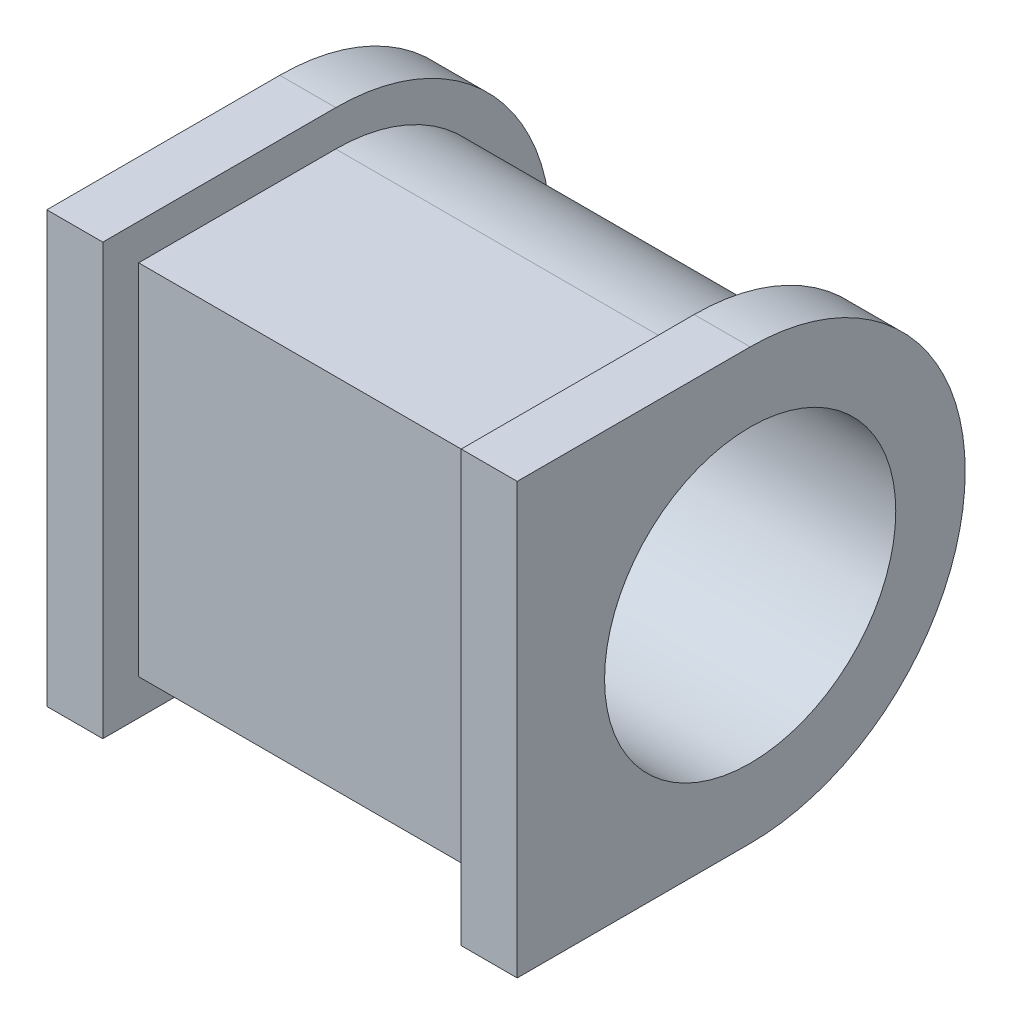
ISO-10303-21;
HEADER;
FILE_DESCRIPTION(('STEP AP214'),'2;1');
FILE_NAME('part.step','',(''),(''),'','','');
FILE_SCHEMA(('AUTOMOTIVE_DESIGN { 1 0 10303 214 1 1 1 1 }'));
ENDSEC;
DATA;
#1=APPLICATION_CONTEXT('core data for automotive mechanical design processes');
#2=APPLICATION_PROTOCOL_DEFINITION('international standard','automotive_design',2000,#1);
#3=PRODUCT_CONTEXT('',#1,'mechanical');
#4=PRODUCT('Part','Part','',(#3));
#5=PRODUCT_RELATED_PRODUCT_CATEGORY('part','',(#4));
#6=PRODUCT_DEFINITION_FORMATION('','',#4);
#7=PRODUCT_DEFINITION_CONTEXT('part definition',#1,'design');
#8=PRODUCT_DEFINITION('design','',#6,#7);
#9=PRODUCT_DEFINITION_SHAPE('','',#8);
#10=(LENGTH_UNIT() NAMED_UNIT(*) SI_UNIT(.MILLI.,.METRE.));
#11=(NAMED_UNIT(*) PLANE_ANGLE_UNIT() SI_UNIT($,.RADIAN.));
#12=(NAMED_UNIT(*) SI_UNIT($,.STERADIAN.) SOLID_ANGLE_UNIT());
#13=UNCERTAINTY_MEASURE_WITH_UNIT(LENGTH_MEASURE(1.E-05),#10,'distance_accuracy_value','');
#14=(GEOMETRIC_REPRESENTATION_CONTEXT(3) GLOBAL_UNCERTAINTY_ASSIGNED_CONTEXT((#13)) GLOBAL_UNIT_ASSIGNED_CONTEXT((#10,
#11,#12)) REPRESENTATION_CONTEXT('',''));
#15=CARTESIAN_POINT('',(0.,0.,0.));
#16=DIRECTION('',(0.,0.,1.));
#17=DIRECTION('',(1.,0.,0.));
#18=AXIS2_PLACEMENT_3D('',#15,#16,#17);
#19=CARTESIAN_POINT('',(12.5,0.,0.));
#20=DIRECTION('',(1.,0.,0.));
#21=DIRECTION('',(0.,0.,-1.));
#22=AXIS2_PLACEMENT_3D('',#19,#20,#21);
#23=PLANE('',#22);
#24=CARTESIAN_POINT('',(12.5,0.,0.));
#25=DIRECTION('',(1.,0.,0.));
#26=DIRECTION('',(0.,0.,-1.));
#27=AXIS2_PLACEMENT_3D('',#24,#25,#26);
#28=CIRCLE('',#27,40.);
#29=CARTESIAN_POINT('',(12.5,-40.,0.));
#30=VERTEX_POINT('',#29);
#31=CARTESIAN_POINT('',(12.5,40.,0.));
#32=VERTEX_POINT('',#31);
#33=EDGE_CURVE('E55',#30,#32,#28,.T.);
#34=ORIENTED_EDGE('',*,*,#33,.F.);
#35=DIRECTION('',(0.,0.,-1.));
#36=VECTOR('',#35,1.);
#37=CARTESIAN_POINT('',(12.5,-40.,44.));
#38=LINE('',#37,#36);
#39=CARTESIAN_POINT('',(12.5,-40.,44.));
#40=VERTEX_POINT('',#39);
#41=EDGE_CURVE('E59',#40,#30,#38,.T.);
#42=ORIENTED_EDGE('',*,*,#41,.F.);
#43=DIRECTION('',(0.,-1.,0.));
#44=VECTOR('',#43,1.);
#45=CARTESIAN_POINT('',(12.5,40.,44.));
#46=LINE('',#45,#44);
#47=CARTESIAN_POINT('',(12.5,40.,44.));
#48=VERTEX_POINT('',#47);
#49=EDGE_CURVE('E185',#48,#40,#46,.T.);
#50=ORIENTED_EDGE('',*,*,#49,.F.);
#51=DIRECTION('',(0.,0.,1.));
#52=VECTOR('',#51,1.);
#53=CARTESIAN_POINT('',(12.5,40.,0.));
#54=LINE('',#53,#52);
#55=EDGE_CURVE('E159',#32,#48,#54,.T.);
#56=ORIENTED_EDGE('',*,*,#55,.F.);
#57=EDGE_LOOP('',(#34,#42,#50,#56));
#58=FACE_BOUND('',#57,.T.);
#59=DIRECTION('',(0.,0.,1.));
#60=VECTOR('',#59,1.);
#61=CARTESIAN_POINT('',(12.5,48.,52.));
#62=LINE('',#61,#60);
#63=CARTESIAN_POINT('',(12.5,48.,0.));
#64=VERTEX_POINT('',#63);
#65=CARTESIAN_POINT('',(12.5,48.,52.));
#66=VERTEX_POINT('',#65);
#67=EDGE_CURVE('E210',#64,#66,#62,.T.);
#68=ORIENTED_EDGE('',*,*,#67,.T.);
#69=DIRECTION('',(0.,-1.,0.));
#70=VECTOR('',#69,1.);
#71=CARTESIAN_POINT('',(12.5,48.,52.));
#72=LINE('',#71,#70);
#73=CARTESIAN_POINT('',(12.5,-48.,52.));
#74=VERTEX_POINT('',#73);
#75=EDGE_CURVE('E214',#66,#74,#72,.T.);
#76=ORIENTED_EDGE('',*,*,#75,.T.);
#77=DIRECTION('',(0.,0.,-1.));
#78=VECTOR('',#77,1.);
#79=CARTESIAN_POINT('',(12.5,-48.,52.));
#80=LINE('',#79,#78);
#81=CARTESIAN_POINT('',(12.5,-48.,0.));
#82=VERTEX_POINT('',#81);
#83=EDGE_CURVE('E218',#74,#82,#80,.T.);
#84=ORIENTED_EDGE('',*,*,#83,.T.);
#85=CARTESIAN_POINT('',(12.5,0.,0.));
#86=DIRECTION('',(1.,0.,0.));
#87=DIRECTION('',(0.,0.,-1.));
#88=AXIS2_PLACEMENT_3D('',#85,#86,#87);
#89=CIRCLE('',#88,48.);
#90=EDGE_CURVE('E221',#82,#64,#89,.T.);
#91=ORIENTED_EDGE('',*,*,#90,.T.);
#92=EDGE_LOOP('',(#68,#76,#84,#91));
#93=FACE_BOUND('',#92,.T.);
#94=ADVANCED_FACE('F39',(#58,#93),#23,.T.);
#95=CARTESIAN_POINT('',(0.,0.,0.));
#96=DIRECTION('',(1.,0.,0.));
#97=DIRECTION('',(0.,0.,-1.));
#98=AXIS2_PLACEMENT_3D('',#95,#96,#97);
#99=PLANE('',#98);
#100=DIRECTION('',(0.,0.,1.));
#101=VECTOR('',#100,1.);
#102=CARTESIAN_POINT('',(0.,48.,52.));
#103=LINE('',#102,#101);
#104=CARTESIAN_POINT('',(0.,48.,0.));
#105=VERTEX_POINT('',#104);
#106=CARTESIAN_POINT('',(0.,48.,52.));
#107=VERTEX_POINT('',#106);
#108=EDGE_CURVE('E209',#105,#107,#103,.T.);
#109=ORIENTED_EDGE('',*,*,#108,.F.);
#110=CARTESIAN_POINT('',(0.,0.,0.));
#111=DIRECTION('',(1.,0.,0.));
#112=DIRECTION('',(0.,0.,-1.));
#113=AXIS2_PLACEMENT_3D('',#110,#111,#112);
#114=CIRCLE('',#113,48.);
#115=CARTESIAN_POINT('',(0.,-48.,0.));
#116=VERTEX_POINT('',#115);
#117=EDGE_CURVE('E215',#116,#105,#114,.T.);
#118=ORIENTED_EDGE('',*,*,#117,.F.);
#119=DIRECTION('',(0.,0.,-1.));
#120=VECTOR('',#119,1.);
#121=CARTESIAN_POINT('',(0.,-48.,52.));
#122=LINE('',#121,#120);
#123=CARTESIAN_POINT('',(0.,-48.,52.));
#124=VERTEX_POINT('',#123);
#125=EDGE_CURVE('E231',#124,#116,#122,.T.);
#126=ORIENTED_EDGE('',*,*,#125,.F.);
#127=DIRECTION('',(0.,-1.,0.));
#128=VECTOR('',#127,1.);
#129=CARTESIAN_POINT('',(0.,48.,52.));
#130=LINE('',#129,#128);
#131=EDGE_CURVE('E228',#107,#124,#130,.T.);
#132=ORIENTED_EDGE('',*,*,#131,.F.);
#133=EDGE_LOOP('',(#109,#118,#126,#132));
#134=FACE_BOUND('',#133,.T.);
#135=CARTESIAN_POINT('',(0.,0.,0.));
#136=DIRECTION('',(1.,0.,0.));
#137=DIRECTION('',(0.,0.,-1.));
#138=AXIS2_PLACEMENT_3D('',#135,#136,#137);
#139=CIRCLE('',#138,32.5);
#140=CARTESIAN_POINT('',(0.,0.,-32.5));
#141=VERTEX_POINT('',#140);
#142=EDGE_CURVE('E205',#141,#141,#139,.T.);
#143=ORIENTED_EDGE('',*,*,#142,.T.);
#144=EDGE_LOOP('',(#143));
#145=FACE_BOUND('',#144,.T.);
#146=ADVANCED_FACE('F254',(#134,#145),#99,.F.);
#147=CARTESIAN_POINT('',(12.5,48.,52.));
#148=DIRECTION('',(0.,-1.,0.));
#149=DIRECTION('',(0.,0.,-1.));
#150=AXIS2_PLACEMENT_3D('',#147,#148,#149);
#151=PLANE('',#150);
#152=ORIENTED_EDGE('',*,*,#108,.T.);
#153=DIRECTION('',(-1.,0.,0.));
#154=VECTOR('',#153,1.);
#155=CARTESIAN_POINT('',(12.5,48.,52.));
#156=LINE('',#155,#154);
#157=EDGE_CURVE('E11',#66,#107,#156,.T.);
#158=ORIENTED_EDGE('',*,*,#157,.F.);
#159=ORIENTED_EDGE('',*,*,#67,.F.);
#160=DIRECTION('',(-1.,0.,0.));
#161=VECTOR('',#160,1.);
#162=CARTESIAN_POINT('',(12.5,48.,0.));
#163=LINE('',#162,#161);
#164=EDGE_CURVE('E224',#64,#105,#163,.T.);
#165=ORIENTED_EDGE('',*,*,#164,.T.);
#166=EDGE_LOOP('',(#152,#158,#159,#165));
#167=FACE_BOUND('',#166,.T.);
#168=ADVANCED_FACE('F41',(#167),#151,.F.);
#169=CARTESIAN_POINT('',(12.5,48.,52.));
#170=DIRECTION('',(0.,0.,-1.));
#171=DIRECTION('',(0.,1.,0.));
#172=AXIS2_PLACEMENT_3D('',#169,#170,#171);
#173=PLANE('',#172);
#174=ORIENTED_EDGE('',*,*,#131,.T.);
#175=DIRECTION('',(-1.,0.,0.));
#176=VECTOR('',#175,1.);
#177=CARTESIAN_POINT('',(12.5,-48.,52.));
#178=LINE('',#177,#176);
#179=EDGE_CURVE('E48',#74,#124,#178,.T.);
#180=ORIENTED_EDGE('',*,*,#179,.F.);
#181=ORIENTED_EDGE('',*,*,#75,.F.);
#182=ORIENTED_EDGE('',*,*,#157,.T.);
#183=EDGE_LOOP('',(#174,#180,#181,#182));
#184=FACE_BOUND('',#183,.T.);
#185=ADVANCED_FACE('F264',(#184),#173,.F.);
#186=CARTESIAN_POINT('',(12.5,-48.,52.));
#187=DIRECTION('',(0.,1.,0.));
#188=DIRECTION('',(0.,0.,1.));
#189=AXIS2_PLACEMENT_3D('',#186,#187,#188);
#190=PLANE('',#189);
#191=ORIENTED_EDGE('',*,*,#125,.T.);
#192=DIRECTION('',(-1.,0.,0.));
#193=VECTOR('',#192,1.);
#194=CARTESIAN_POINT('',(12.5,-48.,0.));
#195=LINE('',#194,#193);
#196=EDGE_CURVE('E239',#82,#116,#195,.T.);
#197=ORIENTED_EDGE('',*,*,#196,.F.);
#198=ORIENTED_EDGE('',*,*,#83,.F.);
#199=ORIENTED_EDGE('',*,*,#179,.T.);
#200=EDGE_LOOP('',(#191,#197,#198,#199));
#201=FACE_BOUND('',#200,.T.);
#202=ADVANCED_FACE('F248',(#201),#190,.F.);
#203=CARTESIAN_POINT('',(12.5,0.,0.));
#204=DIRECTION('',(-1.,0.,0.));
#205=DIRECTION('',(0.,0.,1.));
#206=AXIS2_PLACEMENT_3D('',#203,#204,#205);
#207=CYLINDRICAL_SURFACE('',#206,48.);
#208=ORIENTED_EDGE('',*,*,#117,.T.);
#209=ORIENTED_EDGE('',*,*,#164,.F.);
#210=ORIENTED_EDGE('',*,*,#90,.F.);
#211=ORIENTED_EDGE('',*,*,#196,.T.);
#212=EDGE_LOOP('',(#208,#209,#210,#211));
#213=FACE_BOUND('',#212,.T.);
#214=ADVANCED_FACE('F258',(#213),#207,.T.);
#215=CARTESIAN_POINT('',(12.5,0.,0.));
#216=DIRECTION('',(-1.,0.,0.));
#217=DIRECTION('',(0.,0.,1.));
#218=AXIS2_PLACEMENT_3D('',#215,#216,#217);
#219=CYLINDRICAL_SURFACE('',#218,32.5);
#220=ORIENTED_EDGE('',*,*,#142,.F.);
#221=EDGE_LOOP('',(#220));
#222=FACE_BOUND('',#221,.T.);
#223=CARTESIAN_POINT('',(105.,0.,0.));
#224=DIRECTION('',(1.,0.,0.));
#225=DIRECTION('',(0.,0.,-1.));
#226=AXIS2_PLACEMENT_3D('',#223,#224,#225);
#227=CIRCLE('',#226,32.5);
#228=CARTESIAN_POINT('',(105.,0.,-32.5));
#229=VERTEX_POINT('',#228);
#230=EDGE_CURVE('E296',#229,#229,#227,.T.);
#231=ORIENTED_EDGE('',*,*,#230,.T.);
#232=EDGE_LOOP('',(#231));
#233=FACE_BOUND('',#232,.T.);
#234=ADVANCED_FACE('F278',(#222,#233),#219,.F.);
#235=CARTESIAN_POINT('',(92.5,0.,0.));
#236=DIRECTION('',(-1.,0.,0.));
#237=DIRECTION('',(0.,0.,1.));
#238=AXIS2_PLACEMENT_3D('',#235,#236,#237);
#239=CYLINDRICAL_SURFACE('',#238,40.);
#240=ORIENTED_EDGE('',*,*,#33,.T.);
#241=DIRECTION('',(-1.,0.,0.));
#242=VECTOR('',#241,1.);
#243=CARTESIAN_POINT('',(92.5,40.,0.));
#244=LINE('',#243,#242);
#245=CARTESIAN_POINT('',(92.5,40.,0.));
#246=VERTEX_POINT('',#245);
#247=EDGE_CURVE('E201',#246,#32,#244,.T.);
#248=ORIENTED_EDGE('',*,*,#247,.F.);
#249=CARTESIAN_POINT('',(92.5,0.,0.));
#250=DIRECTION('',(1.,0.,0.));
#251=DIRECTION('',(0.,0.,-1.));
#252=AXIS2_PLACEMENT_3D('',#249,#250,#251);
#253=CIRCLE('',#252,40.);
#254=CARTESIAN_POINT('',(92.5,-40.,0.));
#255=VERTEX_POINT('',#254);
#256=EDGE_CURVE('E165',#255,#246,#253,.T.);
#257=ORIENTED_EDGE('',*,*,#256,.F.);
#258=DIRECTION('',(-1.,0.,0.));
#259=VECTOR('',#258,1.);
#260=CARTESIAN_POINT('',(92.5,-40.,0.));
#261=LINE('',#260,#259);
#262=EDGE_CURVE('E180',#255,#30,#261,.T.);
#263=ORIENTED_EDGE('',*,*,#262,.T.);
#264=EDGE_LOOP('',(#240,#248,#257,#263));
#265=FACE_BOUND('',#264,.T.);
#266=ADVANCED_FACE('F285',(#265),#239,.T.);
#267=CARTESIAN_POINT('',(92.5,40.,0.));
#268=DIRECTION('',(0.,-1.,0.));
#269=DIRECTION('',(0.,0.,-1.));
#270=AXIS2_PLACEMENT_3D('',#267,#268,#269);
#271=PLANE('',#270);
#272=ORIENTED_EDGE('',*,*,#55,.T.);
#273=DIRECTION('',(-1.,0.,0.));
#274=VECTOR('',#273,1.);
#275=CARTESIAN_POINT('',(92.5,40.,44.));
#276=LINE('',#275,#274);
#277=CARTESIAN_POINT('',(92.5,40.,44.));
#278=VERTEX_POINT('',#277);
#279=EDGE_CURVE('E197',#278,#48,#276,.T.);
#280=ORIENTED_EDGE('',*,*,#279,.F.);
#281=DIRECTION('',(0.,0.,1.));
#282=VECTOR('',#281,1.);
#283=CARTESIAN_POINT('',(92.5,40.,0.));
#284=LINE('',#283,#282);
#285=EDGE_CURVE('E169',#246,#278,#284,.T.);
#286=ORIENTED_EDGE('',*,*,#285,.F.);
#287=ORIENTED_EDGE('',*,*,#247,.T.);
#288=EDGE_LOOP('',(#272,#280,#286,#287));
#289=FACE_BOUND('',#288,.T.);
#290=ADVANCED_FACE('F290',(#289),#271,.F.);
#291=CARTESIAN_POINT('',(92.5,40.,44.));
#292=DIRECTION('',(0.,0.,-1.));
#293=DIRECTION('',(0.,1.,0.));
#294=AXIS2_PLACEMENT_3D('',#291,#292,#293);
#295=PLANE('',#294);
#296=ORIENTED_EDGE('',*,*,#49,.T.);
#297=DIRECTION('',(-1.,0.,0.));
#298=VECTOR('',#297,1.);
#299=CARTESIAN_POINT('',(92.5,-40.,44.));
#300=LINE('',#299,#298);
#301=CARTESIAN_POINT('',(92.5,-40.,44.));
#302=VERTEX_POINT('',#301);
#303=EDGE_CURVE('E193',#302,#40,#300,.T.);
#304=ORIENTED_EDGE('',*,*,#303,.F.);
#305=DIRECTION('',(0.,-1.,0.));
#306=VECTOR('',#305,1.);
#307=CARTESIAN_POINT('',(92.5,40.,44.));
#308=LINE('',#307,#306);
#309=EDGE_CURVE('E173',#278,#302,#308,.T.);
#310=ORIENTED_EDGE('',*,*,#309,.F.);
#311=ORIENTED_EDGE('',*,*,#279,.T.);
#312=EDGE_LOOP('',(#296,#304,#310,#311));
#313=FACE_BOUND('',#312,.T.);
#314=ADVANCED_FACE('F343',(#313),#295,.F.);
#315=CARTESIAN_POINT('',(92.5,-40.,44.));
#316=DIRECTION('',(0.,1.,0.));
#317=DIRECTION('',(0.,0.,1.));
#318=AXIS2_PLACEMENT_3D('',#315,#316,#317);
#319=PLANE('',#318);
#320=ORIENTED_EDGE('',*,*,#41,.T.);
#321=ORIENTED_EDGE('',*,*,#262,.F.);
#322=DIRECTION('',(0.,0.,-1.));
#323=VECTOR('',#322,1.);
#324=CARTESIAN_POINT('',(92.5,-40.,44.));
#325=LINE('',#324,#323);
#326=EDGE_CURVE('E177',#302,#255,#325,.T.);
#327=ORIENTED_EDGE('',*,*,#326,.F.);
#328=ORIENTED_EDGE('',*,*,#303,.T.);
#329=EDGE_LOOP('',(#320,#321,#327,#328));
#330=FACE_BOUND('',#329,.T.);
#331=ADVANCED_FACE('F340',(#330),#319,.F.);
#332=CARTESIAN_POINT('',(92.5,0.,0.));
#333=DIRECTION('',(1.,0.,0.));
#334=DIRECTION('',(0.,0.,-1.));
#335=AXIS2_PLACEMENT_3D('',#332,#333,#334);
#336=PLANE('',#335);
#337=CARTESIAN_POINT('',(92.5,0.,0.));
#338=DIRECTION('',(1.,0.,0.));
#339=DIRECTION('',(0.,0.,-1.));
#340=AXIS2_PLACEMENT_3D('',#337,#338,#339);
#341=CIRCLE('',#340,48.);
#342=CARTESIAN_POINT('',(92.5,-48.,0.));
#343=VERTEX_POINT('',#342);
#344=CARTESIAN_POINT('',(92.5,48.,0.));
#345=VERTEX_POINT('',#344);
#346=EDGE_CURVE('E154',#343,#345,#341,.T.);
#347=ORIENTED_EDGE('',*,*,#346,.F.);
#348=DIRECTION('',(0.,0.,-1.));
#349=VECTOR('',#348,1.);
#350=CARTESIAN_POINT('',(92.5,-48.,52.));
#351=LINE('',#350,#349);
#352=CARTESIAN_POINT('',(92.5,-48.,52.));
#353=VERTEX_POINT('',#352);
#354=EDGE_CURVE('E150',#353,#343,#351,.T.);
#355=ORIENTED_EDGE('',*,*,#354,.F.);
#356=DIRECTION('',(0.,-1.,0.));
#357=VECTOR('',#356,1.);
#358=CARTESIAN_POINT('',(92.5,48.,52.));
#359=LINE('',#358,#357);
#360=CARTESIAN_POINT('',(92.5,48.,52.));
#361=VERTEX_POINT('',#360);
#362=EDGE_CURVE('E310',#361,#353,#359,.T.);
#363=ORIENTED_EDGE('',*,*,#362,.F.);
#364=DIRECTION('',(0.,0.,1.));
#365=VECTOR('',#364,1.);
#366=CARTESIAN_POINT('',(92.5,48.,0.));
#367=LINE('',#366,#365);
#368=EDGE_CURVE('E300',#345,#361,#367,.T.);
#369=ORIENTED_EDGE('',*,*,#368,.F.);
#370=EDGE_LOOP('',(#347,#355,#363,#369));
#371=FACE_BOUND('',#370,.T.);
#372=ORIENTED_EDGE('',*,*,#326,.T.);
#373=ORIENTED_EDGE('',*,*,#256,.T.);
#374=ORIENTED_EDGE('',*,*,#285,.T.);
#375=ORIENTED_EDGE('',*,*,#309,.T.);
#376=EDGE_LOOP('',(#372,#373,#374,#375));
#377=FACE_BOUND('',#376,.T.);
#378=ADVANCED_FACE('F325',(#371,#377),#336,.F.);
#379=CARTESIAN_POINT('',(105.,0.,0.));
#380=DIRECTION('',(1.,0.,0.));
#381=DIRECTION('',(0.,0.,-1.));
#382=AXIS2_PLACEMENT_3D('',#379,#380,#381);
#383=PLANE('',#382);
#384=CARTESIAN_POINT('',(105.,0.,0.));
#385=DIRECTION('',(1.,0.,0.));
#386=DIRECTION('',(0.,0.,-1.));
#387=AXIS2_PLACEMENT_3D('',#384,#385,#386);
#388=CIRCLE('',#387,48.);
#389=CARTESIAN_POINT('',(105.,-48.,0.));
#390=VERTEX_POINT('',#389);
#391=CARTESIAN_POINT('',(105.,48.,0.));
#392=VERTEX_POINT('',#391);
#393=EDGE_CURVE('E139',#390,#392,#388,.T.);
#394=ORIENTED_EDGE('',*,*,#393,.T.);
#395=DIRECTION('',(0.,0.,1.));
#396=VECTOR('',#395,1.);
#397=CARTESIAN_POINT('',(105.,48.,0.));
#398=LINE('',#397,#396);
#399=CARTESIAN_POINT('',(105.,48.,52.));
#400=VERTEX_POINT('',#399);
#401=EDGE_CURVE('E127',#392,#400,#398,.T.);
#402=ORIENTED_EDGE('',*,*,#401,.T.);
#403=DIRECTION('',(0.,-1.,0.));
#404=VECTOR('',#403,1.);
#405=CARTESIAN_POINT('',(105.,48.,52.));
#406=LINE('',#405,#404);
#407=CARTESIAN_POINT('',(105.,-48.,52.));
#408=VERTEX_POINT('',#407);
#409=EDGE_CURVE('E138',#400,#408,#406,.T.);
#410=ORIENTED_EDGE('',*,*,#409,.T.);
#411=DIRECTION('',(0.,0.,-1.));
#412=VECTOR('',#411,1.);
#413=CARTESIAN_POINT('',(105.,-48.,52.));
#414=LINE('',#413,#412);
#415=EDGE_CURVE('E145',#408,#390,#414,.T.);
#416=ORIENTED_EDGE('',*,*,#415,.T.);
#417=EDGE_LOOP('',(#394,#402,#410,#416));
#418=FACE_BOUND('',#417,.T.);
#419=ORIENTED_EDGE('',*,*,#230,.F.);
#420=EDGE_LOOP('',(#419));
#421=FACE_BOUND('',#420,.T.);
#422=ADVANCED_FACE('F142',(#418,#421),#383,.T.);
#423=CARTESIAN_POINT('',(105.,0.,0.));
#424=DIRECTION('',(-1.,0.,0.));
#425=DIRECTION('',(0.,0.,1.));
#426=AXIS2_PLACEMENT_3D('',#423,#424,#425);
#427=CYLINDRICAL_SURFACE('',#426,48.);
#428=ORIENTED_EDGE('',*,*,#346,.T.);
#429=DIRECTION('',(-1.,0.,0.));
#430=VECTOR('',#429,1.);
#431=CARTESIAN_POINT('',(105.,48.,0.));
#432=LINE('',#431,#430);
#433=EDGE_CURVE('E131',#392,#345,#432,.T.);
#434=ORIENTED_EDGE('',*,*,#433,.F.);
#435=ORIENTED_EDGE('',*,*,#393,.F.);
#436=DIRECTION('',(-1.,0.,0.));
#437=VECTOR('',#436,1.);
#438=CARTESIAN_POINT('',(105.,-48.,0.));
#439=LINE('',#438,#437);
#440=EDGE_CURVE('E306',#390,#343,#439,.T.);
#441=ORIENTED_EDGE('',*,*,#440,.T.);
#442=EDGE_LOOP('',(#428,#434,#435,#441));
#443=FACE_BOUND('',#442,.T.);
#444=ADVANCED_FACE('F152',(#443),#427,.T.);
#445=CARTESIAN_POINT('',(105.,48.,0.));
#446=DIRECTION('',(0.,-1.,0.));
#447=DIRECTION('',(0.,0.,-1.));
#448=AXIS2_PLACEMENT_3D('',#445,#446,#447);
#449=PLANE('',#448);
#450=ORIENTED_EDGE('',*,*,#368,.T.);
#451=DIRECTION('',(-1.,0.,0.));
#452=VECTOR('',#451,1.);
#453=CARTESIAN_POINT('',(105.,48.,52.));
#454=LINE('',#453,#452);
#455=EDGE_CURVE('E134',#400,#361,#454,.T.);
#456=ORIENTED_EDGE('',*,*,#455,.F.);
#457=ORIENTED_EDGE('',*,*,#401,.F.);
#458=ORIENTED_EDGE('',*,*,#433,.T.);
#459=EDGE_LOOP('',(#450,#456,#457,#458));
#460=FACE_BOUND('',#459,.T.);
#461=ADVANCED_FACE('F129',(#460),#449,.F.);
#462=CARTESIAN_POINT('',(105.,48.,52.));
#463=DIRECTION('',(0.,0.,-1.));
#464=DIRECTION('',(0.,1.,0.));
#465=AXIS2_PLACEMENT_3D('',#462,#463,#464);
#466=PLANE('',#465);
#467=ORIENTED_EDGE('',*,*,#362,.T.);
#468=DIRECTION('',(-1.,0.,0.));
#469=VECTOR('',#468,1.);
#470=CARTESIAN_POINT('',(105.,-48.,52.));
#471=LINE('',#470,#469);
#472=EDGE_CURVE('E161',#408,#353,#471,.T.);
#473=ORIENTED_EDGE('',*,*,#472,.F.);
#474=ORIENTED_EDGE('',*,*,#409,.F.);
#475=ORIENTED_EDGE('',*,*,#455,.T.);
#476=EDGE_LOOP('',(#467,#473,#474,#475));
#477=FACE_BOUND('',#476,.T.);
#478=ADVANCED_FACE('F327',(#477),#466,.F.);
#479=CARTESIAN_POINT('',(105.,-48.,52.));
#480=DIRECTION('',(0.,1.,0.));
#481=DIRECTION('',(0.,0.,1.));
#482=AXIS2_PLACEMENT_3D('',#479,#480,#481);
#483=PLANE('',#482);
#484=ORIENTED_EDGE('',*,*,#354,.T.);
#485=ORIENTED_EDGE('',*,*,#440,.F.);
#486=ORIENTED_EDGE('',*,*,#415,.F.);
#487=ORIENTED_EDGE('',*,*,#472,.T.);
#488=EDGE_LOOP('',(#484,#485,#486,#487));
#489=FACE_BOUND('',#488,.T.);
#490=ADVANCED_FACE('F321',(#489),#483,.F.);
#491=CLOSED_SHELL('',(#94,#146,#168,#185,#202,#214,#234,#266,#290,#314,#331,#378,#422,#444,#461,
#478,#490));
#492=MANIFOLD_SOLID_BREP('B2',#491);
#493=ADVANCED_BREP_SHAPE_REPRESENTATION('',(#18,#492),#14);
#494=SHAPE_DEFINITION_REPRESENTATION(#9,#493);
ENDSEC;
END-ISO-10303-21;
